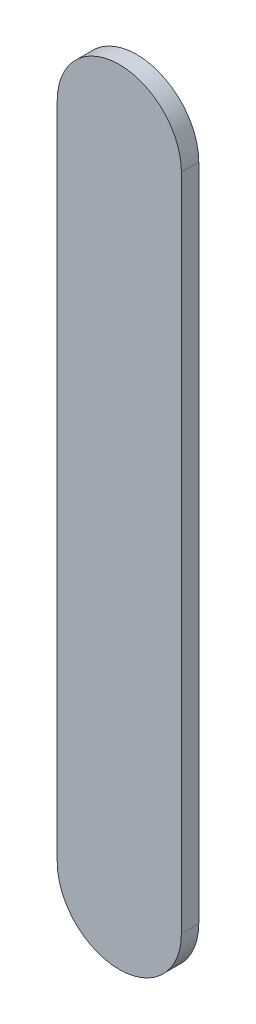
ISO-10303-21;
HEADER;
FILE_DESCRIPTION(('STEP AP214'),'2;1');
FILE_NAME('part.step','',(''),(''),'','','');
FILE_SCHEMA(('AUTOMOTIVE_DESIGN { 1 0 10303 214 1 1 1 1 }'));
ENDSEC;
DATA;
#1=APPLICATION_CONTEXT('core data for automotive mechanical design processes');
#2=APPLICATION_PROTOCOL_DEFINITION('international standard','automotive_design',2000,#1);
#3=PRODUCT_CONTEXT('',#1,'mechanical');
#4=PRODUCT('Part','Part','',(#3));
#5=PRODUCT_RELATED_PRODUCT_CATEGORY('part','',(#4));
#6=PRODUCT_DEFINITION_FORMATION('','',#4);
#7=PRODUCT_DEFINITION_CONTEXT('part definition',#1,'design');
#8=PRODUCT_DEFINITION('design','',#6,#7);
#9=PRODUCT_DEFINITION_SHAPE('','',#8);
#10=(LENGTH_UNIT() NAMED_UNIT(*) SI_UNIT(.MILLI.,.METRE.));
#11=(NAMED_UNIT(*) PLANE_ANGLE_UNIT() SI_UNIT($,.RADIAN.));
#12=(NAMED_UNIT(*) SI_UNIT($,.STERADIAN.) SOLID_ANGLE_UNIT());
#13=UNCERTAINTY_MEASURE_WITH_UNIT(LENGTH_MEASURE(1.E-05),#10,'distance_accuracy_value','');
#14=(GEOMETRIC_REPRESENTATION_CONTEXT(3) GLOBAL_UNCERTAINTY_ASSIGNED_CONTEXT((#13)) GLOBAL_UNIT_ASSIGNED_CONTEXT((#10,
#11,#12)) REPRESENTATION_CONTEXT('',''));
#15=CARTESIAN_POINT('',(0.,0.,0.));
#16=DIRECTION('',(0.,0.,1.));
#17=DIRECTION('',(1.,0.,0.));
#18=AXIS2_PLACEMENT_3D('',#15,#16,#17);
#19=CARTESIAN_POINT('',(95.394018,85.6869508,0.));
#20=DIRECTION('',(-1.,0.,0.));
#21=DIRECTION('',(0.,1.,0.));
#22=AXIS2_PLACEMENT_3D('',#19,#20,#21);
#23=PLANE('',#22);
#24=DIRECTION('',(0.,1.,0.));
#25=VECTOR('',#24,1.);
#26=CARTESIAN_POINT('',(95.394018,85.6869508,0.03556));
#27=LINE('',#26,#25);
#28=CARTESIAN_POINT('',(95.394018,85.6869508,0.03556));
#29=VERTEX_POINT('',#28);
#30=CARTESIAN_POINT('',(95.394018,87.03692778,0.03556));
#31=VERTEX_POINT('',#30);
#32=EDGE_CURVE('E11',#29,#31,#27,.T.);
#33=ORIENTED_EDGE('',*,*,#32,.F.);
#34=DIRECTION('',(0.,0.,1.));
#35=VECTOR('',#34,1.);
#36=CARTESIAN_POINT('',(95.394018,85.6869508,0.));
#37=LINE('',#36,#35);
#38=CARTESIAN_POINT('',(95.394018,85.6869508,0.));
#39=VERTEX_POINT('',#38);
#40=EDGE_CURVE('E24',#39,#29,#37,.T.);
#41=ORIENTED_EDGE('',*,*,#40,.F.);
#42=DIRECTION('',(0.,1.,0.));
#43=VECTOR('',#42,1.);
#44=CARTESIAN_POINT('',(95.394018,85.6869508,0.));
#45=LINE('',#44,#43);
#46=CARTESIAN_POINT('',(95.394018,87.03692778,0.));
#47=VERTEX_POINT('',#46);
#48=EDGE_CURVE('E75',#39,#47,#45,.T.);
#49=ORIENTED_EDGE('',*,*,#48,.T.);
#50=DIRECTION('',(0.,0.,1.));
#51=VECTOR('',#50,1.);
#52=CARTESIAN_POINT('',(95.394018,87.03692778,0.));
#53=LINE('',#52,#51);
#54=EDGE_CURVE('E37',#47,#31,#53,.T.);
#55=ORIENTED_EDGE('',*,*,#54,.T.);
#56=EDGE_LOOP('',(#33,#41,#49,#55));
#57=FACE_BOUND('',#56,.T.);
#58=ADVANCED_FACE('F17',(#57),#23,.F.);
#59=CARTESIAN_POINT('',(95.267018,87.03692778,0.));
#60=DIRECTION('',(0.,0.,-1.));
#61=DIRECTION('',(1.,0.,0.));
#62=AXIS2_PLACEMENT_3D('',#59,#60,#61);
#63=CYLINDRICAL_SURFACE('',#62,0.126999999999995);
#64=CARTESIAN_POINT('',(95.267018,87.03692778,0.03556));
#65=DIRECTION('',(0.,0.,1.));
#66=DIRECTION('',(1.,0.,0.));
#67=AXIS2_PLACEMENT_3D('',#64,#65,#66);
#68=CIRCLE('',#67,0.126999999999995);
#69=CARTESIAN_POINT('',(95.140018,87.03692778,0.03556));
#70=VERTEX_POINT('',#69);
#71=EDGE_CURVE('E83',#31,#70,#68,.T.);
#72=ORIENTED_EDGE('',*,*,#71,.F.);
#73=ORIENTED_EDGE('',*,*,#54,.F.);
#74=CARTESIAN_POINT('',(95.267018,87.03692778,0.));
#75=DIRECTION('',(0.,0.,1.));
#76=DIRECTION('',(1.,0.,0.));
#77=AXIS2_PLACEMENT_3D('',#74,#75,#76);
#78=CIRCLE('',#77,0.126999999999995);
#79=CARTESIAN_POINT('',(95.140018,87.03692778,0.));
#80=VERTEX_POINT('',#79);
#81=EDGE_CURVE('E81',#47,#80,#78,.T.);
#82=ORIENTED_EDGE('',*,*,#81,.T.);
#83=DIRECTION('',(0.,0.,1.));
#84=VECTOR('',#83,1.);
#85=CARTESIAN_POINT('',(95.140018,87.03692778,0.));
#86=LINE('',#85,#84);
#87=EDGE_CURVE('E67',#80,#70,#86,.T.);
#88=ORIENTED_EDGE('',*,*,#87,.T.);
#89=EDGE_LOOP('',(#72,#73,#82,#88));
#90=FACE_BOUND('',#89,.T.);
#91=ADVANCED_FACE('F89',(#90),#63,.T.);
#92=CARTESIAN_POINT('',(95.140018,87.03692778,0.));
#93=DIRECTION('',(1.,0.,0.));
#94=DIRECTION('',(0.,-1.,0.));
#95=AXIS2_PLACEMENT_3D('',#92,#93,#94);
#96=PLANE('',#95);
#97=DIRECTION('',(0.,-1.,0.));
#98=VECTOR('',#97,1.);
#99=CARTESIAN_POINT('',(95.140018,87.03692778,0.03556));
#100=LINE('',#99,#98);
#101=CARTESIAN_POINT('',(95.140018,85.6869508,0.03556));
#102=VERTEX_POINT('',#101);
#103=EDGE_CURVE('E71',#70,#102,#100,.T.);
#104=ORIENTED_EDGE('',*,*,#103,.F.);
#105=ORIENTED_EDGE('',*,*,#87,.F.);
#106=DIRECTION('',(0.,-1.,0.));
#107=VECTOR('',#106,1.);
#108=CARTESIAN_POINT('',(95.140018,87.03692778,0.));
#109=LINE('',#108,#107);
#110=CARTESIAN_POINT('',(95.140018,85.6869508,0.));
#111=VERTEX_POINT('',#110);
#112=EDGE_CURVE('E63',#80,#111,#109,.T.);
#113=ORIENTED_EDGE('',*,*,#112,.T.);
#114=DIRECTION('',(0.,0.,1.));
#115=VECTOR('',#114,1.);
#116=CARTESIAN_POINT('',(95.140018,85.6869508,0.));
#117=LINE('',#116,#115);
#118=EDGE_CURVE('E53',#111,#102,#117,.T.);
#119=ORIENTED_EDGE('',*,*,#118,.T.);
#120=EDGE_LOOP('',(#104,#105,#113,#119));
#121=FACE_BOUND('',#120,.T.);
#122=ADVANCED_FACE('F66',(#121),#96,.F.);
#123=CARTESIAN_POINT('',(95.267018,85.6869508,0.));
#124=DIRECTION('',(0.,0.,-1.));
#125=DIRECTION('',(-1.,0.,0.));
#126=AXIS2_PLACEMENT_3D('',#123,#124,#125);
#127=CYLINDRICAL_SURFACE('',#126,0.126999999999995);
#128=CARTESIAN_POINT('',(95.267018,85.6869508,0.03556));
#129=DIRECTION('',(0.,0.,1.));
#130=DIRECTION('',(-1.,0.,0.));
#131=AXIS2_PLACEMENT_3D('',#128,#129,#130);
#132=CIRCLE('',#131,0.126999999999995);
#133=EDGE_CURVE('E59',#102,#29,#132,.T.);
#134=ORIENTED_EDGE('',*,*,#133,.F.);
#135=ORIENTED_EDGE('',*,*,#118,.F.);
#136=CARTESIAN_POINT('',(95.267018,85.6869508,0.));
#137=DIRECTION('',(0.,0.,1.));
#138=DIRECTION('',(-1.,0.,0.));
#139=AXIS2_PLACEMENT_3D('',#136,#137,#138);
#140=CIRCLE('',#139,0.126999999999995);
#141=EDGE_CURVE('E57',#111,#39,#140,.T.);
#142=ORIENTED_EDGE('',*,*,#141,.T.);
#143=ORIENTED_EDGE('',*,*,#40,.T.);
#144=EDGE_LOOP('',(#134,#135,#142,#143));
#145=FACE_BOUND('',#144,.T.);
#146=ADVANCED_FACE('F55',(#145),#127,.T.);
#147=CARTESIAN_POINT('',(95.394018,85.6869508,0.));
#148=DIRECTION('',(0.,0.,-1.));
#149=DIRECTION('',(-1.,0.,0.));
#150=AXIS2_PLACEMENT_3D('',#147,#148,#149);
#151=PLANE('',#150);
#152=ORIENTED_EDGE('',*,*,#141,.F.);
#153=ORIENTED_EDGE('',*,*,#112,.F.);
#154=ORIENTED_EDGE('',*,*,#81,.F.);
#155=ORIENTED_EDGE('',*,*,#48,.F.);
#156=EDGE_LOOP('',(#152,#153,#154,#155));
#157=FACE_BOUND('',#156,.T.);
#158=ADVANCED_FACE('F74',(#157),#151,.T.);
#159=CARTESIAN_POINT('',(95.394018,85.6869508,0.03556));
#160=DIRECTION('',(0.,0.,-1.));
#161=DIRECTION('',(-1.,0.,0.));
#162=AXIS2_PLACEMENT_3D('',#159,#160,#161);
#163=PLANE('',#162);
#164=ORIENTED_EDGE('',*,*,#32,.T.);
#165=ORIENTED_EDGE('',*,*,#71,.T.);
#166=ORIENTED_EDGE('',*,*,#103,.T.);
#167=ORIENTED_EDGE('',*,*,#133,.T.);
#168=EDGE_LOOP('',(#164,#165,#166,#167));
#169=FACE_BOUND('',#168,.T.);
#170=ADVANCED_FACE('F91',(#169),#163,.F.);
#171=CLOSED_SHELL('',(#58,#91,#122,#146,#158,#170));
#172=MANIFOLD_SOLID_BREP('B1',#171);
#173=ADVANCED_BREP_SHAPE_REPRESENTATION('',(#18,#172),#14);
#174=SHAPE_DEFINITION_REPRESENTATION(#9,#173);
ENDSEC;
END-ISO-10303-21;
